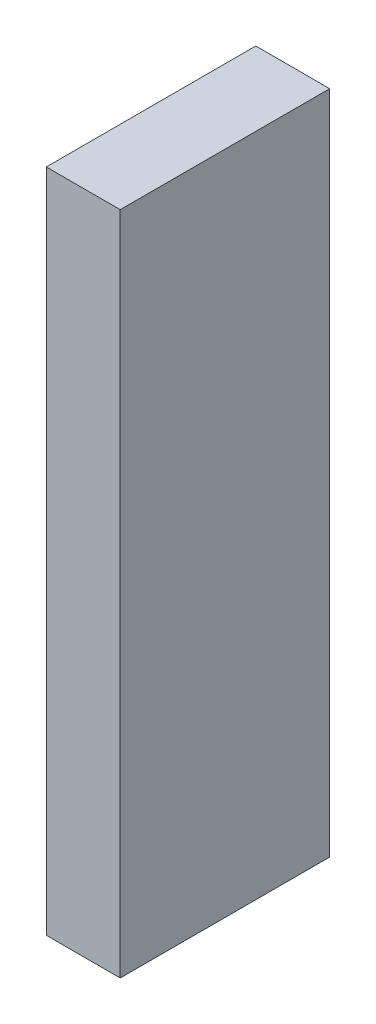
ISO-10303-21;
HEADER;
FILE_DESCRIPTION(('STEP AP214'),'2;1');
FILE_NAME('part.step','',(''),(''),'','','');
FILE_SCHEMA(('AUTOMOTIVE_DESIGN { 1 0 10303 214 1 1 1 1 }'));
ENDSEC;
DATA;
#1=APPLICATION_CONTEXT('core data for automotive mechanical design processes');
#2=APPLICATION_PROTOCOL_DEFINITION('international standard','automotive_design',2000,#1);
#3=PRODUCT_CONTEXT('',#1,'mechanical');
#4=PRODUCT('Part','Part','',(#3));
#5=PRODUCT_RELATED_PRODUCT_CATEGORY('part','',(#4));
#6=PRODUCT_DEFINITION_FORMATION('','',#4);
#7=PRODUCT_DEFINITION_CONTEXT('part definition',#1,'design');
#8=PRODUCT_DEFINITION('design','',#6,#7);
#9=PRODUCT_DEFINITION_SHAPE('','',#8);
#10=(LENGTH_UNIT() NAMED_UNIT(*) SI_UNIT(.MILLI.,.METRE.));
#11=(NAMED_UNIT(*) PLANE_ANGLE_UNIT() SI_UNIT($,.RADIAN.));
#12=(NAMED_UNIT(*) SI_UNIT($,.STERADIAN.) SOLID_ANGLE_UNIT());
#13=UNCERTAINTY_MEASURE_WITH_UNIT(LENGTH_MEASURE(1.E-05),#10,'distance_accuracy_value','');
#14=(GEOMETRIC_REPRESENTATION_CONTEXT(3) GLOBAL_UNCERTAINTY_ASSIGNED_CONTEXT((#13)) GLOBAL_UNIT_ASSIGNED_CONTEXT((#10,
#11,#12)) REPRESENTATION_CONTEXT('',''));
#15=CARTESIAN_POINT('',(0.,0.,0.));
#16=DIRECTION('',(0.,0.,1.));
#17=DIRECTION('',(1.,0.,0.));
#18=AXIS2_PLACEMENT_3D('',#15,#16,#17);
#19=CARTESIAN_POINT('',(2.44999827226896,2.70000476165285,0.));
#20=DIRECTION('',(-1.,8.74227765734759E-08,0.));
#21=DIRECTION('',(-8.74227765734759E-08,-1.,0.));
#22=AXIS2_PLACEMENT_3D('',#19,#20,#21);
#23=PLANE('',#22);
#24=DIRECTION('',(-8.74227765512293E-08,-0.999999999999996,0.));
#25=VECTOR('',#24,1.);
#26=CARTESIAN_POINT('',(2.44999827226896,2.70000476165285,0.));
#27=LINE('',#26,#25);
#28=CARTESIAN_POINT('',(2.44999827226896,2.70000476165285,0.));
#29=VERTEX_POINT('',#28);
#30=CARTESIAN_POINT('',(2.44999780018649,-2.69998913483153,0.));
#31=VERTEX_POINT('',#30);
#32=EDGE_CURVE('E11',#29,#31,#27,.T.);
#33=ORIENTED_EDGE('',*,*,#32,.T.);
#34=DIRECTION('',(0.,0.,1.));
#35=VECTOR('',#34,1.);
#36=CARTESIAN_POINT('',(2.4499978001865,-2.69998913483153,0.));
#37=LINE('',#36,#35);
#38=CARTESIAN_POINT('',(2.44999780018649,-2.69998913483153,1.6999990940094));
#39=VERTEX_POINT('',#38);
#40=EDGE_CURVE('E88',#31,#39,#37,.T.);
#41=ORIENTED_EDGE('',*,*,#40,.T.);
#42=DIRECTION('',(-8.74227765512293E-08,-0.999999999999996,0.));
#43=VECTOR('',#42,1.);
#44=CARTESIAN_POINT('',(2.44999827226896,2.70000476165285,1.6999990940094));
#45=LINE('',#44,#43);
#46=CARTESIAN_POINT('',(2.44999827226896,2.70000476165285,1.6999990940094));
#47=VERTEX_POINT('',#46);
#48=EDGE_CURVE('E83',#47,#39,#45,.T.);
#49=ORIENTED_EDGE('',*,*,#48,.F.);
#50=DIRECTION('',(0.,0.,1.));
#51=VECTOR('',#50,1.);
#52=CARTESIAN_POINT('',(2.44999827226896,2.70000476165284,0.));
#53=LINE('',#52,#51);
#54=EDGE_CURVE('E72',#29,#47,#53,.T.);
#55=ORIENTED_EDGE('',*,*,#54,.F.);
#56=EDGE_LOOP('',(#33,#41,#49,#55));
#57=FACE_BOUND('',#56,.T.);
#58=ADVANCED_FACE('F17',(#57),#23,.T.);
#59=CARTESIAN_POINT('',(2.44999780018649,-2.69998913483153,0.));
#60=DIRECTION('',(-8.74227765734759E-08,-1.,0.));
#61=DIRECTION('',(1.,-8.74227765734759E-08,0.));
#62=AXIS2_PLACEMENT_3D('',#59,#60,#61);
#63=PLANE('',#62);
#64=DIRECTION('',(0.999999999999996,-8.7422776708459E-08,0.));
#65=VECTOR('',#64,1.);
#66=CARTESIAN_POINT('',(2.44999780018649,-2.69998913483153,0.));
#67=LINE('',#66,#65);
#68=CARTESIAN_POINT('',(3.04999627430759,-2.69998918728507,0.));
#69=VERTEX_POINT('',#68);
#70=EDGE_CURVE('E24',#31,#69,#67,.T.);
#71=ORIENTED_EDGE('',*,*,#70,.T.);
#72=DIRECTION('',(0.,0.,1.));
#73=VECTOR('',#72,1.);
#74=CARTESIAN_POINT('',(3.04999627430759,-2.69998918728506,0.));
#75=LINE('',#74,#73);
#76=CARTESIAN_POINT('',(3.04999627430759,-2.69998918728507,1.6999990940094));
#77=VERTEX_POINT('',#76);
#78=EDGE_CURVE('E85',#69,#77,#75,.T.);
#79=ORIENTED_EDGE('',*,*,#78,.T.);
#80=DIRECTION('',(0.999999999999996,-8.7422776708459E-08,0.));
#81=VECTOR('',#80,1.);
#82=CARTESIAN_POINT('',(2.44999780018649,-2.69998913483153,1.6999990940094));
#83=LINE('',#82,#81);
#84=EDGE_CURVE('E66',#39,#77,#83,.T.);
#85=ORIENTED_EDGE('',*,*,#84,.F.);
#86=ORIENTED_EDGE('',*,*,#40,.F.);
#87=EDGE_LOOP('',(#71,#79,#85,#86));
#88=FACE_BOUND('',#87,.T.);
#89=ADVANCED_FACE('F89',(#88),#63,.T.);
#90=CARTESIAN_POINT('',(3.04999627430759,-2.69998918728507,0.));
#91=DIRECTION('',(1.,-8.74227765734759E-08,0.));
#92=DIRECTION('',(8.74227765734759E-08,1.,0.));
#93=AXIS2_PLACEMENT_3D('',#90,#91,#92);
#94=PLANE('',#93);
#95=DIRECTION('',(8.74227765512293E-08,0.999999999999996,0.));
#96=VECTOR('',#95,1.);
#97=CARTESIAN_POINT('',(3.04999627430759,-2.69998918728507,0.));
#98=LINE('',#97,#96);
#99=CARTESIAN_POINT('',(3.04999674639005,2.70000470919931,0.));
#100=VERTEX_POINT('',#99);
#101=EDGE_CURVE('E62',#69,#100,#98,.T.);
#102=ORIENTED_EDGE('',*,*,#101,.T.);
#103=DIRECTION('',(0.,0.,1.));
#104=VECTOR('',#103,1.);
#105=CARTESIAN_POINT('',(3.04999674639005,2.70000470919931,0.));
#106=LINE('',#105,#104);
#107=CARTESIAN_POINT('',(3.04999674639005,2.70000470919931,1.6999990940094));
#108=VERTEX_POINT('',#107);
#109=EDGE_CURVE('E55',#100,#108,#106,.T.);
#110=ORIENTED_EDGE('',*,*,#109,.T.);
#111=DIRECTION('',(8.74227765512293E-08,0.999999999999996,0.));
#112=VECTOR('',#111,1.);
#113=CARTESIAN_POINT('',(3.04999627430759,-2.69998918728507,1.6999990940094));
#114=LINE('',#113,#112);
#115=EDGE_CURVE('E59',#77,#108,#114,.T.);
#116=ORIENTED_EDGE('',*,*,#115,.F.);
#117=ORIENTED_EDGE('',*,*,#78,.F.);
#118=EDGE_LOOP('',(#102,#110,#116,#117));
#119=FACE_BOUND('',#118,.T.);
#120=ADVANCED_FACE('F57',(#119),#94,.T.);
#121=CARTESIAN_POINT('',(3.04999674639005,2.70000470919931,0.));
#122=DIRECTION('',(8.74227765734759E-08,1.,0.));
#123=DIRECTION('',(-1.,8.74227765734759E-08,0.));
#124=AXIS2_PLACEMENT_3D('',#121,#122,#123);
#125=PLANE('',#124);
#126=DIRECTION('',(-0.999999999999996,8.7422776708459E-08,0.));
#127=VECTOR('',#126,1.);
#128=CARTESIAN_POINT('',(3.04999674639005,2.70000470919931,0.));
#129=LINE('',#128,#127);
#130=EDGE_CURVE('E65',#100,#29,#129,.T.);
#131=ORIENTED_EDGE('',*,*,#130,.T.);
#132=ORIENTED_EDGE('',*,*,#54,.T.);
#133=DIRECTION('',(-0.999999999999996,8.7422776708459E-08,0.));
#134=VECTOR('',#133,1.);
#135=CARTESIAN_POINT('',(3.04999674639005,2.70000470919931,1.6999990940094));
#136=LINE('',#135,#134);
#137=EDGE_CURVE('E70',#108,#47,#136,.T.);
#138=ORIENTED_EDGE('',*,*,#137,.F.);
#139=ORIENTED_EDGE('',*,*,#109,.F.);
#140=EDGE_LOOP('',(#131,#132,#138,#139));
#141=FACE_BOUND('',#140,.T.);
#142=ADVANCED_FACE('F71',(#141),#125,.T.);
#143=CARTESIAN_POINT('',(91.8250045776367,74.8249969482422,1.6999990940094));
#144=DIRECTION('',(0.,0.,1.));
#145=DIRECTION('',(-1.,8.74227765734759E-08,0.));
#146=AXIS2_PLACEMENT_3D('',#143,#144,#145);
#147=PLANE('',#146);
#148=ORIENTED_EDGE('',*,*,#48,.T.);
#149=ORIENTED_EDGE('',*,*,#84,.T.);
#150=ORIENTED_EDGE('',*,*,#115,.T.);
#151=ORIENTED_EDGE('',*,*,#137,.T.);
#152=EDGE_LOOP('',(#148,#149,#150,#151));
#153=FACE_BOUND('',#152,.T.);
#154=ADVANCED_FACE('F76',(#153),#147,.T.);
#155=CARTESIAN_POINT('',(91.8250045776367,74.8249969482422,0.));
#156=DIRECTION('',(0.,0.,1.));
#157=DIRECTION('',(-1.,8.74227765734759E-08,0.));
#158=AXIS2_PLACEMENT_3D('',#155,#156,#157);
#159=PLANE('',#158);
#160=ORIENTED_EDGE('',*,*,#130,.F.);
#161=ORIENTED_EDGE('',*,*,#101,.F.);
#162=ORIENTED_EDGE('',*,*,#70,.F.);
#163=ORIENTED_EDGE('',*,*,#32,.F.);
#164=EDGE_LOOP('',(#160,#161,#162,#163));
#165=FACE_BOUND('',#164,.T.);
#166=ADVANCED_FACE('F91',(#165),#159,.F.);
#167=CLOSED_SHELL('',(#58,#89,#120,#142,#154,#166));
#168=MANIFOLD_SOLID_BREP('B1',#167);
#169=ADVANCED_BREP_SHAPE_REPRESENTATION('',(#18,#168),#14);
#170=SHAPE_DEFINITION_REPRESENTATION(#9,#169);
ENDSEC;
END-ISO-10303-21;
